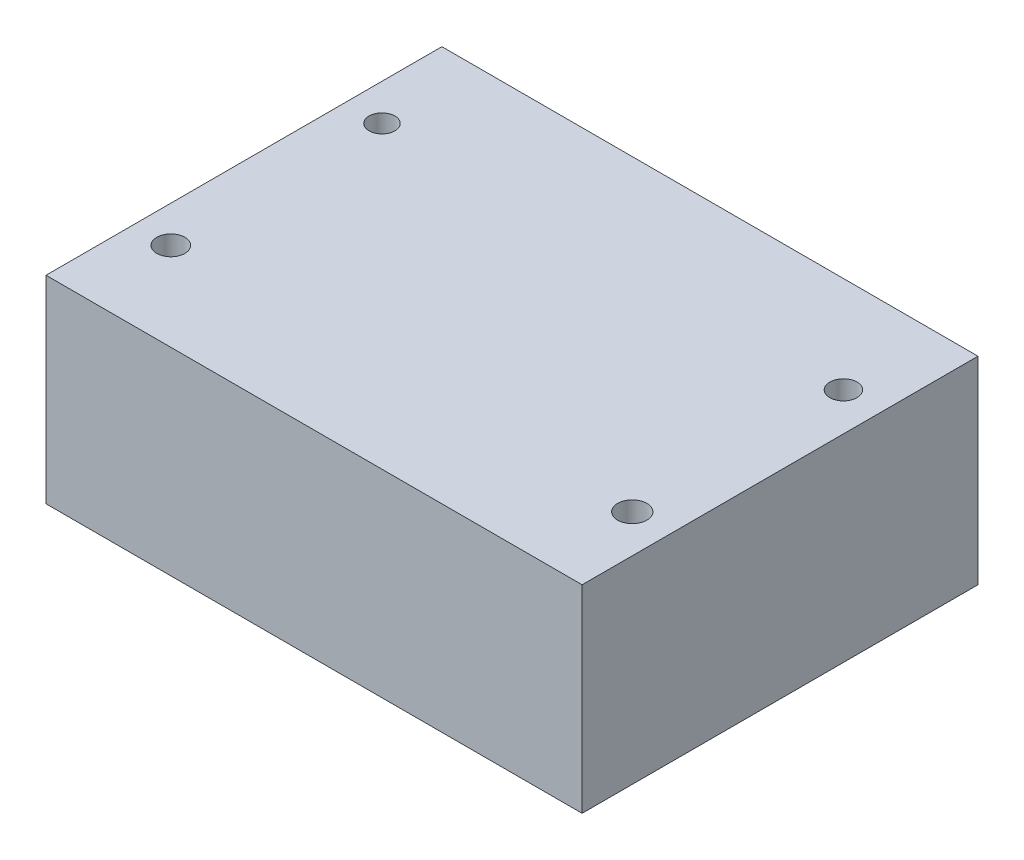
ISO-10303-21;
HEADER;
FILE_DESCRIPTION(('STEP AP214'),'2;1');
FILE_NAME('part.step','',(''),(''),'','','');
FILE_SCHEMA(('AUTOMOTIVE_DESIGN { 1 0 10303 214 1 1 1 1 }'));
ENDSEC;
DATA;
#1=APPLICATION_CONTEXT('core data for automotive mechanical design processes');
#2=APPLICATION_PROTOCOL_DEFINITION('international standard','automotive_design',2000,#1);
#3=PRODUCT_CONTEXT('',#1,'mechanical');
#4=PRODUCT('Part','Part','',(#3));
#5=PRODUCT_RELATED_PRODUCT_CATEGORY('part','',(#4));
#6=PRODUCT_DEFINITION_FORMATION('','',#4);
#7=PRODUCT_DEFINITION_CONTEXT('part definition',#1,'design');
#8=PRODUCT_DEFINITION('design','',#6,#7);
#9=PRODUCT_DEFINITION_SHAPE('','',#8);
#10=(LENGTH_UNIT() NAMED_UNIT(*) SI_UNIT(.MILLI.,.METRE.));
#11=(NAMED_UNIT(*) PLANE_ANGLE_UNIT() SI_UNIT($,.RADIAN.));
#12=(NAMED_UNIT(*) SI_UNIT($,.STERADIAN.) SOLID_ANGLE_UNIT());
#13=UNCERTAINTY_MEASURE_WITH_UNIT(LENGTH_MEASURE(1.E-05),#10,'distance_accuracy_value','');
#14=(GEOMETRIC_REPRESENTATION_CONTEXT(3) GLOBAL_UNCERTAINTY_ASSIGNED_CONTEXT((#13)) GLOBAL_UNIT_ASSIGNED_CONTEXT((#10,
#11,#12)) REPRESENTATION_CONTEXT('',''));
#15=CARTESIAN_POINT('',(0.,0.,0.));
#16=DIRECTION('',(0.,0.,1.));
#17=DIRECTION('',(1.,0.,0.));
#18=AXIS2_PLACEMENT_3D('',#15,#16,#17);
#19=CARTESIAN_POINT('',(32.5,24.,13.1785714285714));
#20=DIRECTION('',(-1.,0.,0.));
#21=DIRECTION('',(0.,0.,1.));
#22=AXIS2_PLACEMENT_3D('',#19,#20,#21);
#23=PLANE('',#22);
#24=DIRECTION('',(0.,0.,-1.));
#25=VECTOR('',#24,1.);
#26=CARTESIAN_POINT('',(32.5,0.,13.1785714285714));
#27=LINE('',#26,#25);
#28=CARTESIAN_POINT('',(32.5,0.,13.1785714285714));
#29=VERTEX_POINT('',#28);
#30=CARTESIAN_POINT('',(32.5,0.,-34.8214285714286));
#31=VERTEX_POINT('',#30);
#32=EDGE_CURVE('E117',#29,#31,#27,.T.);
#33=ORIENTED_EDGE('',*,*,#32,.T.);
#34=DIRECTION('',(0.,-1.,0.));
#35=VECTOR('',#34,1.);
#36=CARTESIAN_POINT('',(32.5,24.,-34.8214285714286));
#37=LINE('',#36,#35);
#38=CARTESIAN_POINT('',(32.5,24.,-34.8214285714286));
#39=VERTEX_POINT('',#38);
#40=EDGE_CURVE('E11',#39,#31,#37,.T.);
#41=ORIENTED_EDGE('',*,*,#40,.F.);
#42=DIRECTION('',(0.,0.,-1.));
#43=VECTOR('',#42,1.);
#44=CARTESIAN_POINT('',(32.5,24.,13.1785714285714));
#45=LINE('',#44,#43);
#46=CARTESIAN_POINT('',(32.5,24.,13.1785714285714));
#47=VERTEX_POINT('',#46);
#48=EDGE_CURVE('E100',#47,#39,#45,.T.);
#49=ORIENTED_EDGE('',*,*,#48,.F.);
#50=DIRECTION('',(0.,-1.,0.));
#51=VECTOR('',#50,1.);
#52=CARTESIAN_POINT('',(32.5,24.,13.1785714285714));
#53=LINE('',#52,#51);
#54=EDGE_CURVE('E113',#47,#29,#53,.T.);
#55=ORIENTED_EDGE('',*,*,#54,.T.);
#56=EDGE_LOOP('',(#33,#41,#49,#55));
#57=FACE_BOUND('',#56,.T.);
#58=ADVANCED_FACE('F46',(#57),#23,.F.);
#59=CARTESIAN_POINT('',(-32.5,24.,-34.8214285714286));
#60=DIRECTION('',(0.,0.,1.));
#61=DIRECTION('',(1.,0.,0.));
#62=AXIS2_PLACEMENT_3D('',#59,#60,#61);
#63=PLANE('',#62);
#64=DIRECTION('',(-1.,0.,0.));
#65=VECTOR('',#64,1.);
#66=CARTESIAN_POINT('',(-32.5,0.,-34.8214285714286));
#67=LINE('',#66,#65);
#68=CARTESIAN_POINT('',(-32.5,0.,-34.8214285714286));
#69=VERTEX_POINT('',#68);
#70=EDGE_CURVE('E105',#31,#69,#67,.T.);
#71=ORIENTED_EDGE('',*,*,#70,.T.);
#72=DIRECTION('',(0.,-1.,0.));
#73=VECTOR('',#72,1.);
#74=CARTESIAN_POINT('',(-32.5,24.,-34.8214285714286));
#75=LINE('',#74,#73);
#76=CARTESIAN_POINT('',(-32.5,24.,-34.8214285714286));
#77=VERTEX_POINT('',#76);
#78=EDGE_CURVE('E56',#77,#69,#75,.T.);
#79=ORIENTED_EDGE('',*,*,#78,.F.);
#80=DIRECTION('',(-1.,0.,0.));
#81=VECTOR('',#80,1.);
#82=CARTESIAN_POINT('',(-32.5,24.,-34.8214285714286));
#83=LINE('',#82,#81);
#84=EDGE_CURVE('E95',#39,#77,#83,.T.);
#85=ORIENTED_EDGE('',*,*,#84,.F.);
#86=ORIENTED_EDGE('',*,*,#40,.T.);
#87=EDGE_LOOP('',(#71,#79,#85,#86));
#88=FACE_BOUND('',#87,.T.);
#89=ADVANCED_FACE('F104',(#88),#63,.F.);
#90=CARTESIAN_POINT('',(-32.5,24.,13.1785714285714));
#91=DIRECTION('',(1.,0.,0.));
#92=DIRECTION('',(0.,0.,-1.));
#93=AXIS2_PLACEMENT_3D('',#90,#91,#92);
#94=PLANE('',#93);
#95=DIRECTION('',(0.,0.,1.));
#96=VECTOR('',#95,1.);
#97=CARTESIAN_POINT('',(-32.5,0.,13.1785714285714));
#98=LINE('',#97,#96);
#99=CARTESIAN_POINT('',(-32.5,0.,13.1785714285714));
#100=VERTEX_POINT('',#99);
#101=EDGE_CURVE('E82',#69,#100,#98,.T.);
#102=ORIENTED_EDGE('',*,*,#101,.T.);
#103=DIRECTION('',(0.,-1.,0.));
#104=VECTOR('',#103,1.);
#105=CARTESIAN_POINT('',(-32.5,24.,13.1785714285714));
#106=LINE('',#105,#104);
#107=CARTESIAN_POINT('',(-32.5,24.,13.1785714285714));
#108=VERTEX_POINT('',#107);
#109=EDGE_CURVE('E107',#108,#100,#106,.T.);
#110=ORIENTED_EDGE('',*,*,#109,.F.);
#111=DIRECTION('',(0.,0.,1.));
#112=VECTOR('',#111,1.);
#113=CARTESIAN_POINT('',(-32.5,24.,13.1785714285714));
#114=LINE('',#113,#112);
#115=EDGE_CURVE('E98',#77,#108,#114,.T.);
#116=ORIENTED_EDGE('',*,*,#115,.F.);
#117=ORIENTED_EDGE('',*,*,#78,.T.);
#118=EDGE_LOOP('',(#102,#110,#116,#117));
#119=FACE_BOUND('',#118,.T.);
#120=ADVANCED_FACE('F109',(#119),#94,.F.);
#121=CARTESIAN_POINT('',(-32.5,24.,13.1785714285714));
#122=DIRECTION('',(0.,0.,-1.));
#123=DIRECTION('',(-1.,0.,0.));
#124=AXIS2_PLACEMENT_3D('',#121,#122,#123);
#125=PLANE('',#124);
#126=DIRECTION('',(1.,0.,0.));
#127=VECTOR('',#126,1.);
#128=CARTESIAN_POINT('',(-32.5,0.,13.1785714285714));
#129=LINE('',#128,#127);
#130=EDGE_CURVE('E88',#100,#29,#129,.T.);
#131=ORIENTED_EDGE('',*,*,#130,.T.);
#132=ORIENTED_EDGE('',*,*,#54,.F.);
#133=DIRECTION('',(1.,0.,0.));
#134=VECTOR('',#133,1.);
#135=CARTESIAN_POINT('',(-32.5,24.,13.1785714285714));
#136=LINE('',#135,#134);
#137=EDGE_CURVE('E65',#108,#47,#136,.T.);
#138=ORIENTED_EDGE('',*,*,#137,.F.);
#139=ORIENTED_EDGE('',*,*,#109,.T.);
#140=EDGE_LOOP('',(#131,#132,#138,#139));
#141=FACE_BOUND('',#140,.T.);
#142=ADVANCED_FACE('F163',(#141),#125,.F.);
#143=CARTESIAN_POINT('',(0.,24.,0.));
#144=DIRECTION('',(0.,-1.,0.));
#145=DIRECTION('',(0.,0.,-1.));
#146=AXIS2_PLACEMENT_3D('',#143,#144,#145);
#147=PLANE('',#146);
#148=CARTESIAN_POINT('',(-28.0721462939161,24.,2.47271499247414));
#149=DIRECTION('',(0.,1.,0.));
#150=DIRECTION('',(0.,0.,1.));
#151=AXIS2_PLACEMENT_3D('',#148,#149,#150);
#152=CIRCLE('',#151,1.70205805744905);
#153=CARTESIAN_POINT('',(-28.0721462939161,24.,4.17477304992319));
#154=VERTEX_POINT('',#153);
#155=EDGE_CURVE('E248',#154,#154,#152,.T.);
#156=ORIENTED_EDGE('',*,*,#155,.F.);
#157=EDGE_LOOP('',(#156));
#158=FACE_BOUND('',#157,.T.);
#159=CARTESIAN_POINT('',(27.8752638637778,24.,2.47271499247414));
#160=DIRECTION('',(0.,1.,0.));
#161=DIRECTION('',(0.,0.,1.));
#162=AXIS2_PLACEMENT_3D('',#159,#160,#161);
#163=CIRCLE('',#162,1.77218792036171);
#164=CARTESIAN_POINT('',(27.8752638637778,24.,4.24490291283585));
#165=VERTEX_POINT('',#164);
#166=EDGE_CURVE('E244',#165,#165,#163,.T.);
#167=ORIENTED_EDGE('',*,*,#166,.F.);
#168=EDGE_LOOP('',(#167));
#169=FACE_BOUND('',#168,.T.);
#170=CARTESIAN_POINT('',(27.8752638637778,24.,-23.1293733792864));
#171=DIRECTION('',(0.,1.,0.));
#172=DIRECTION('',(0.,0.,1.));
#173=AXIS2_PLACEMENT_3D('',#170,#171,#172);
#174=CIRCLE('',#173,1.6482240531864);
#175=CARTESIAN_POINT('',(27.8752638637778,24.,-21.4811493261));
#176=VERTEX_POINT('',#175);
#177=EDGE_CURVE('E247',#176,#176,#174,.T.);
#178=ORIENTED_EDGE('',*,*,#177,.F.);
#179=EDGE_LOOP('',(#178));
#180=FACE_BOUND('',#179,.T.);
#181=CARTESIAN_POINT('',(-28.0721462939161,24.,-23.1293733792864));
#182=DIRECTION('',(0.,1.,0.));
#183=DIRECTION('',(0.,0.,1.));
#184=AXIS2_PLACEMENT_3D('',#181,#182,#183);
#185=CIRCLE('',#184,1.56603955413069);
#186=CARTESIAN_POINT('',(-28.0721462939161,24.,-21.5633338251557));
#187=VERTEX_POINT('',#186);
#188=EDGE_CURVE('E136',#187,#187,#185,.T.);
#189=ORIENTED_EDGE('',*,*,#188,.F.);
#190=EDGE_LOOP('',(#189));
#191=FACE_BOUND('',#190,.T.);
#192=ORIENTED_EDGE('',*,*,#48,.T.);
#193=ORIENTED_EDGE('',*,*,#84,.T.);
#194=ORIENTED_EDGE('',*,*,#115,.T.);
#195=ORIENTED_EDGE('',*,*,#137,.T.);
#196=EDGE_LOOP('',(#192,#193,#194,#195));
#197=FACE_BOUND('',#196,.T.);
#198=ADVANCED_FACE('F96',(#158,#169,#180,#191,#197),#147,.F.);
#199=CARTESIAN_POINT('',(0.,0.,0.));
#200=DIRECTION('',(0.,-1.,0.));
#201=DIRECTION('',(0.,0.,-1.));
#202=AXIS2_PLACEMENT_3D('',#199,#200,#201);
#203=PLANE('',#202);
#204=CARTESIAN_POINT('',(-28.0721462939161,0.,2.47271499247414));
#205=DIRECTION('',(0.,-1.,0.));
#206=DIRECTION('',(0.,0.,-1.));
#207=AXIS2_PLACEMENT_3D('',#204,#205,#206);
#208=CIRCLE('',#207,1.70205805744905);
#209=CARTESIAN_POINT('',(-28.0721462939161,0.,0.770656935025089));
#210=VERTEX_POINT('',#209);
#211=EDGE_CURVE('E49',#210,#210,#208,.T.);
#212=ORIENTED_EDGE('',*,*,#211,.F.);
#213=EDGE_LOOP('',(#212));
#214=FACE_BOUND('',#213,.T.);
#215=CARTESIAN_POINT('',(27.8752638637778,0.,2.47271499247414));
#216=DIRECTION('',(0.,-1.,0.));
#217=DIRECTION('',(0.,0.,-1.));
#218=AXIS2_PLACEMENT_3D('',#215,#216,#217);
#219=CIRCLE('',#218,1.77218792036171);
#220=CARTESIAN_POINT('',(27.8752638637778,0.,0.700527072112423));
#221=VERTEX_POINT('',#220);
#222=EDGE_CURVE('E139',#221,#221,#219,.T.);
#223=ORIENTED_EDGE('',*,*,#222,.F.);
#224=EDGE_LOOP('',(#223));
#225=FACE_BOUND('',#224,.T.);
#226=CARTESIAN_POINT('',(27.8752638637778,0.,-23.1293733792864));
#227=DIRECTION('',(0.,-1.,0.));
#228=DIRECTION('',(0.,0.,-1.));
#229=AXIS2_PLACEMENT_3D('',#226,#227,#228);
#230=CIRCLE('',#229,1.6482240531864);
#231=CARTESIAN_POINT('',(27.8752638637778,0.,-24.7775974324728));
#232=VERTEX_POINT('',#231);
#233=EDGE_CURVE('E135',#232,#232,#230,.T.);
#234=ORIENTED_EDGE('',*,*,#233,.F.);
#235=EDGE_LOOP('',(#234));
#236=FACE_BOUND('',#235,.T.);
#237=CARTESIAN_POINT('',(-28.0721462939161,0.,-23.1293733792864));
#238=DIRECTION('',(0.,-1.,0.));
#239=DIRECTION('',(0.,0.,-1.));
#240=AXIS2_PLACEMENT_3D('',#237,#238,#239);
#241=CIRCLE('',#240,1.56603955413069);
#242=CARTESIAN_POINT('',(-28.0721462939161,0.,-24.6954129334171));
#243=VERTEX_POINT('',#242);
#244=EDGE_CURVE('E131',#243,#243,#241,.T.);
#245=ORIENTED_EDGE('',*,*,#244,.F.);
#246=EDGE_LOOP('',(#245));
#247=FACE_BOUND('',#246,.T.);
#248=ORIENTED_EDGE('',*,*,#32,.F.);
#249=ORIENTED_EDGE('',*,*,#130,.F.);
#250=ORIENTED_EDGE('',*,*,#101,.F.);
#251=ORIENTED_EDGE('',*,*,#70,.F.);
#252=EDGE_LOOP('',(#248,#249,#250,#251));
#253=FACE_BOUND('',#252,.T.);
#254=ADVANCED_FACE('F151',(#214,#225,#236,#247,#253),#203,.T.);
#255=CARTESIAN_POINT('',(-28.0721462939161,-6.,-23.1293733792864));
#256=DIRECTION('',(0.,1.,0.));
#257=DIRECTION('',(0.,0.,1.));
#258=AXIS2_PLACEMENT_3D('',#255,#256,#257);
#259=CYLINDRICAL_SURFACE('',#258,1.56603955413069);
#260=ORIENTED_EDGE('',*,*,#244,.T.);
#261=EDGE_LOOP('',(#260));
#262=FACE_BOUND('',#261,.T.);
#263=ORIENTED_EDGE('',*,*,#188,.T.);
#264=EDGE_LOOP('',(#263));
#265=FACE_BOUND('',#264,.T.);
#266=ADVANCED_FACE('F154',(#262,#265),#259,.F.);
#267=CARTESIAN_POINT('',(27.8752638637778,-6.,-23.1293733792864));
#268=DIRECTION('',(0.,1.,0.));
#269=DIRECTION('',(0.,0.,1.));
#270=AXIS2_PLACEMENT_3D('',#267,#268,#269);
#271=CYLINDRICAL_SURFACE('',#270,1.6482240531864);
#272=ORIENTED_EDGE('',*,*,#233,.T.);
#273=EDGE_LOOP('',(#272));
#274=FACE_BOUND('',#273,.T.);
#275=ORIENTED_EDGE('',*,*,#177,.T.);
#276=EDGE_LOOP('',(#275));
#277=FACE_BOUND('',#276,.T.);
#278=ADVANCED_FACE('F211',(#274,#277),#271,.F.);
#279=CARTESIAN_POINT('',(27.8752638637778,-6.,2.47271499247414));
#280=DIRECTION('',(0.,1.,0.));
#281=DIRECTION('',(0.,0.,1.));
#282=AXIS2_PLACEMENT_3D('',#279,#280,#281);
#283=CYLINDRICAL_SURFACE('',#282,1.77218792036171);
#284=ORIENTED_EDGE('',*,*,#222,.T.);
#285=EDGE_LOOP('',(#284));
#286=FACE_BOUND('',#285,.T.);
#287=ORIENTED_EDGE('',*,*,#166,.T.);
#288=EDGE_LOOP('',(#287));
#289=FACE_BOUND('',#288,.T.);
#290=ADVANCED_FACE('F221',(#286,#289),#283,.F.);
#291=CARTESIAN_POINT('',(-28.0721462939161,-6.,2.47271499247414));
#292=DIRECTION('',(0.,1.,0.));
#293=DIRECTION('',(0.,0.,1.));
#294=AXIS2_PLACEMENT_3D('',#291,#292,#293);
#295=CYLINDRICAL_SURFACE('',#294,1.70205805744905);
#296=ORIENTED_EDGE('',*,*,#211,.T.);
#297=EDGE_LOOP('',(#296));
#298=FACE_BOUND('',#297,.T.);
#299=ORIENTED_EDGE('',*,*,#155,.T.);
#300=EDGE_LOOP('',(#299));
#301=FACE_BOUND('',#300,.T.);
#302=ADVANCED_FACE('F148',(#298,#301),#295,.F.);
#303=CLOSED_SHELL('',(#58,#89,#120,#142,#198,#254,#266,#278,#290,#302));
#304=MANIFOLD_SOLID_BREP('B2',#303);
#305=ADVANCED_BREP_SHAPE_REPRESENTATION('',(#18,#304),#14);
#306=SHAPE_DEFINITION_REPRESENTATION(#9,#305);
ENDSEC;
END-ISO-10303-21;
